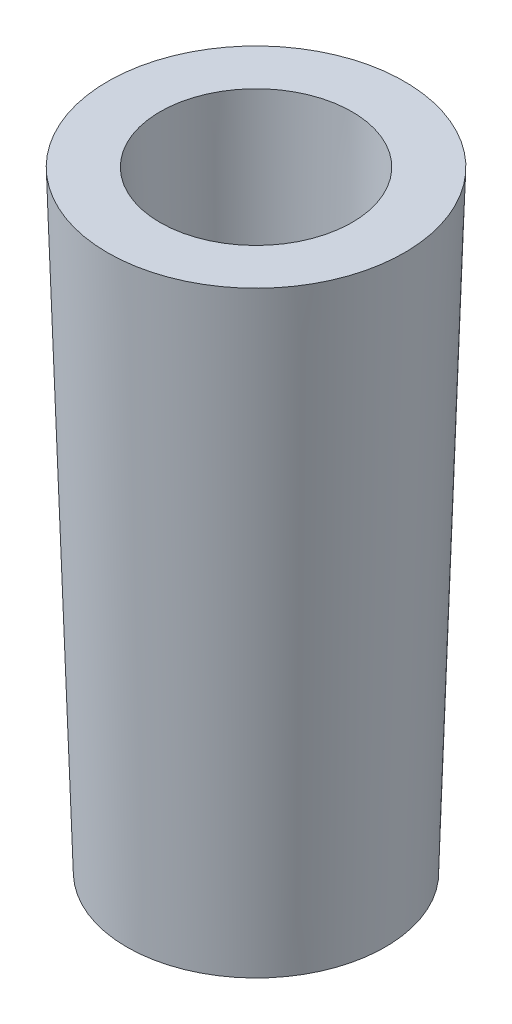
ISO-10303-21;
HEADER;
FILE_DESCRIPTION(('STEP AP214'),'2;1');
FILE_NAME('part.step','',(''),(''),'','','');
FILE_SCHEMA(('AUTOMOTIVE_DESIGN { 1 0 10303 214 1 1 1 1 }'));
ENDSEC;
DATA;
#1=APPLICATION_CONTEXT('core data for automotive mechanical design processes');
#2=APPLICATION_PROTOCOL_DEFINITION('international standard','automotive_design',2000,#1);
#3=PRODUCT_CONTEXT('',#1,'mechanical');
#4=PRODUCT('Part','Part','',(#3));
#5=PRODUCT_RELATED_PRODUCT_CATEGORY('part','',(#4));
#6=PRODUCT_DEFINITION_FORMATION('','',#4);
#7=PRODUCT_DEFINITION_CONTEXT('part definition',#1,'design');
#8=PRODUCT_DEFINITION('design','',#6,#7);
#9=PRODUCT_DEFINITION_SHAPE('','',#8);
#10=(LENGTH_UNIT() NAMED_UNIT(*) SI_UNIT(.MILLI.,.METRE.));
#11=(NAMED_UNIT(*) PLANE_ANGLE_UNIT() SI_UNIT($,.RADIAN.));
#12=(NAMED_UNIT(*) SI_UNIT($,.STERADIAN.) SOLID_ANGLE_UNIT());
#13=UNCERTAINTY_MEASURE_WITH_UNIT(LENGTH_MEASURE(1.E-05),#10,'distance_accuracy_value','');
#14=(GEOMETRIC_REPRESENTATION_CONTEXT(3) GLOBAL_UNCERTAINTY_ASSIGNED_CONTEXT((#13)) GLOBAL_UNIT_ASSIGNED_CONTEXT((#10,
#11,#12)) REPRESENTATION_CONTEXT('',''));
#15=CARTESIAN_POINT('',(0.,0.,0.));
#16=DIRECTION('',(0.,0.,1.));
#17=DIRECTION('',(1.,0.,0.));
#18=AXIS2_PLACEMENT_3D('',#15,#16,#17);
#19=CARTESIAN_POINT('',(0.,0.,0.));
#20=DIRECTION('',(0.,1.,0.));
#21=DIRECTION('',(0.,0.,1.));
#22=AXIS2_PLACEMENT_3D('',#19,#20,#21);
#23=PLANE('',#22);
#24=CARTESIAN_POINT('',(0.,0.,0.));
#25=DIRECTION('',(0.,1.,0.));
#26=DIRECTION('',(0.,0.,1.));
#27=AXIS2_PLACEMENT_3D('',#24,#25,#26);
#28=CIRCLE('',#27,7.4014812669611);
#29=CARTESIAN_POINT('',(0.,0.,7.4014812669611));
#30=VERTEX_POINT('',#29);
#31=EDGE_CURVE('E42',#30,#30,#28,.T.);
#32=ORIENTED_EDGE('',*,*,#31,.F.);
#33=EDGE_LOOP('',(#32));
#34=FACE_BOUND('',#33,.T.);
#35=CARTESIAN_POINT('',(0.,0.,0.));
#36=DIRECTION('',(0.,1.,0.));
#37=DIRECTION('',(0.,0.,1.));
#38=AXIS2_PLACEMENT_3D('',#35,#36,#37);
#39=CIRCLE('',#38,4.4);
#40=CARTESIAN_POINT('',(0.,0.,4.4));
#41=VERTEX_POINT('',#40);
#42=EDGE_CURVE('E50',#41,#41,#39,.T.);
#43=ORIENTED_EDGE('',*,*,#42,.T.);
#44=EDGE_LOOP('',(#43));
#45=FACE_BOUND('',#44,.T.);
#46=ADVANCED_FACE('F35',(#34,#45),#23,.F.);
#47=CARTESIAN_POINT('',(0.,35.,0.));
#48=DIRECTION('',(0.,1.,0.));
#49=DIRECTION('',(0.,0.,1.));
#50=AXIS2_PLACEMENT_3D('',#47,#48,#49);
#51=PLANE('',#50);
#52=CARTESIAN_POINT('',(0.,35.,0.));
#53=DIRECTION('',(0.,1.,0.));
#54=DIRECTION('',(0.,0.,1.));
#55=AXIS2_PLACEMENT_3D('',#52,#53,#54);
#56=CIRCLE('',#55,5.5);
#57=CARTESIAN_POINT('',(0.,35.,5.5));
#58=VERTEX_POINT('',#57);
#59=EDGE_CURVE('E46',#58,#58,#56,.T.);
#60=ORIENTED_EDGE('',*,*,#59,.F.);
#61=EDGE_LOOP('',(#60));
#62=FACE_BOUND('',#61,.T.);
#63=CARTESIAN_POINT('',(0.,35.,0.));
#64=DIRECTION('',(0.,1.,0.));
#65=DIRECTION('',(0.,0.,1.));
#66=AXIS2_PLACEMENT_3D('',#63,#64,#65);
#67=CIRCLE('',#66,8.50148126696109);
#68=CARTESIAN_POINT('',(0.,35.,8.50148126696109));
#69=VERTEX_POINT('',#68);
#70=EDGE_CURVE('E11',#69,#69,#67,.T.);
#71=ORIENTED_EDGE('',*,*,#70,.T.);
#72=EDGE_LOOP('',(#71));
#73=FACE_BOUND('',#72,.T.);
#74=ADVANCED_FACE('F63',(#62,#73),#51,.T.);
#75=CARTESIAN_POINT('',(0.,-0.0942391831562309,0.));
#76=DIRECTION('',(0.,1.,0.));
#77=DIRECTION('',(0.,0.,1.));
#78=AXIS2_PLACEMENT_3D('',#75,#76,#77);
#79=CONICAL_SURFACE('',#78,7.3985194640619,0.0314182296463759);
#80=ORIENTED_EDGE('',*,*,#31,.T.);
#81=EDGE_LOOP('',(#80));
#82=FACE_BOUND('',#81,.T.);
#83=ORIENTED_EDGE('',*,*,#70,.F.);
#84=EDGE_LOOP('',(#83));
#85=FACE_BOUND('',#84,.T.);
#86=ADVANCED_FACE('F37',(#82,#85),#79,.T.);
#87=CARTESIAN_POINT('',(0.,0.,0.));
#88=DIRECTION('',(0.,1.,0.));
#89=DIRECTION('',(0.,0.,1.));
#90=AXIS2_PLACEMENT_3D('',#87,#88,#89);
#91=CONICAL_SURFACE('',#90,4.4,0.0314182296463759);
#92=ORIENTED_EDGE('',*,*,#42,.F.);
#93=EDGE_LOOP('',(#92));
#94=FACE_BOUND('',#93,.T.);
#95=ORIENTED_EDGE('',*,*,#59,.T.);
#96=EDGE_LOOP('',(#95));
#97=FACE_BOUND('',#96,.T.);
#98=ADVANCED_FACE('F57',(#94,#97),#91,.F.);
#99=CLOSED_SHELL('',(#46,#74,#86,#98));
#100=MANIFOLD_SOLID_BREP('B2',#99);
#101=ADVANCED_BREP_SHAPE_REPRESENTATION('',(#18,#100),#14);
#102=SHAPE_DEFINITION_REPRESENTATION(#9,#101);
ENDSEC;
END-ISO-10303-21;
